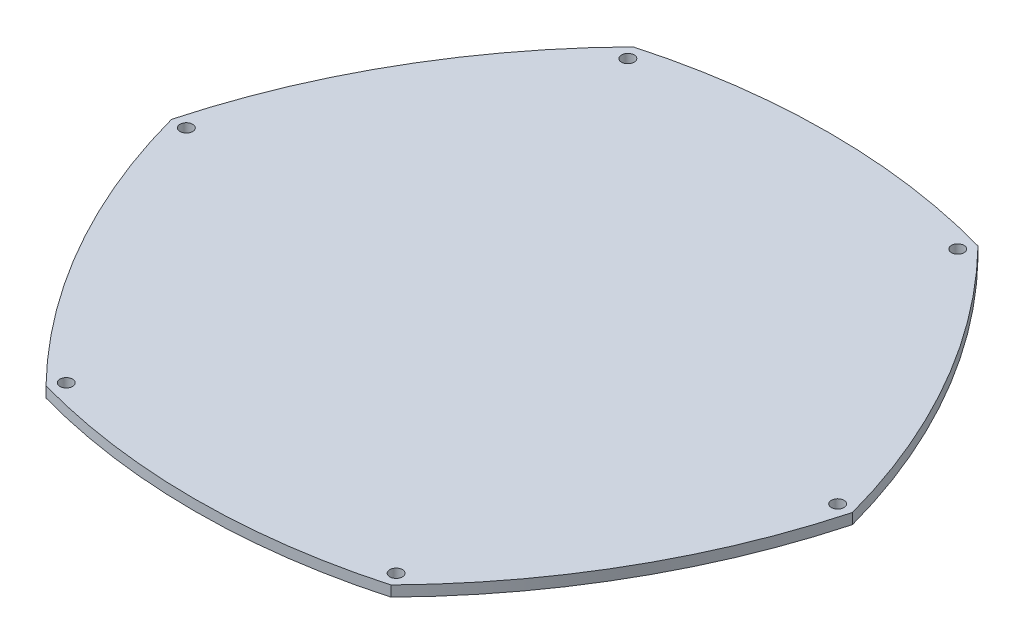
ISO-10303-21;
HEADER;
FILE_DESCRIPTION(('STEP AP214'),'2;1');
FILE_NAME('part.step','',(''),(''),'','','');
FILE_SCHEMA(('AUTOMOTIVE_DESIGN { 1 0 10303 214 1 1 1 1 }'));
ENDSEC;
DATA;
#1=APPLICATION_CONTEXT('core data for automotive mechanical design processes');
#2=APPLICATION_PROTOCOL_DEFINITION('international standard','automotive_design',2000,#1);
#3=PRODUCT_CONTEXT('',#1,'mechanical');
#4=PRODUCT('Part','Part','',(#3));
#5=PRODUCT_RELATED_PRODUCT_CATEGORY('part','',(#4));
#6=PRODUCT_DEFINITION_FORMATION('','',#4);
#7=PRODUCT_DEFINITION_CONTEXT('part definition',#1,'design');
#8=PRODUCT_DEFINITION('design','',#6,#7);
#9=PRODUCT_DEFINITION_SHAPE('','',#8);
#10=(LENGTH_UNIT() NAMED_UNIT(*) SI_UNIT(.MILLI.,.METRE.));
#11=(NAMED_UNIT(*) PLANE_ANGLE_UNIT() SI_UNIT($,.RADIAN.));
#12=(NAMED_UNIT(*) SI_UNIT($,.STERADIAN.) SOLID_ANGLE_UNIT());
#13=UNCERTAINTY_MEASURE_WITH_UNIT(LENGTH_MEASURE(1.E-05),#10,'distance_accuracy_value','');
#14=(GEOMETRIC_REPRESENTATION_CONTEXT(3) GLOBAL_UNCERTAINTY_ASSIGNED_CONTEXT((#13)) GLOBAL_UNIT_ASSIGNED_CONTEXT((#10,
#11,#12)) REPRESENTATION_CONTEXT('',''));
#15=CARTESIAN_POINT('',(0.,0.,0.));
#16=DIRECTION('',(0.,0.,1.));
#17=DIRECTION('',(1.,0.,0.));
#18=AXIS2_PLACEMENT_3D('',#15,#16,#17);
#19=CARTESIAN_POINT('',(72.2865141140493,2.5,-41.3732927207822));
#20=DIRECTION('',(0.,-1.,0.));
#21=DIRECTION('',(0.,0.,-1.));
#22=AXIS2_PLACEMENT_3D('',#19,#20,#21);
#23=CYLINDRICAL_SURFACE('',#22,158.289191815746);
#24=CARTESIAN_POINT('',(72.2865141140493,0.,-41.3732927207822));
#25=DIRECTION('',(0.,1.,0.));
#26=DIRECTION('',(0.,0.,1.));
#27=AXIS2_PLACEMENT_3D('',#24,#25,#26);
#28=CIRCLE('',#27,158.289191815746);
#29=CARTESIAN_POINT('',(-80.5,0.,4.71844785465692E-13));
#30=VERTEX_POINT('',#29);
#31=CARTESIAN_POINT('',(-40.7727272727273,0.,69.4106239040091));
#32=VERTEX_POINT('',#31);
#33=EDGE_CURVE('E137',#30,#32,#28,.T.);
#34=ORIENTED_EDGE('',*,*,#33,.T.);
#35=DIRECTION('',(0.,-1.,0.));
#36=VECTOR('',#35,1.);
#37=CARTESIAN_POINT('',(-40.7727272727273,2.5,69.4106239040091));
#38=LINE('',#37,#36);
#39=CARTESIAN_POINT('',(-40.7727272727273,2.5,69.4106239040091));
#40=VERTEX_POINT('',#39);
#41=EDGE_CURVE('E11',#40,#32,#38,.T.);
#42=ORIENTED_EDGE('',*,*,#41,.F.);
#43=CARTESIAN_POINT('',(72.2865141140493,2.5,-41.3732927207822));
#44=DIRECTION('',(0.,1.,0.));
#45=DIRECTION('',(0.,0.,1.));
#46=AXIS2_PLACEMENT_3D('',#43,#44,#45);
#47=CIRCLE('',#46,158.289191815746);
#48=CARTESIAN_POINT('',(-80.5,2.5,4.71844785465692E-13));
#49=VERTEX_POINT('',#48);
#50=EDGE_CURVE('E168',#49,#40,#47,.T.);
#51=ORIENTED_EDGE('',*,*,#50,.F.);
#52=DIRECTION('',(0.,-1.,0.));
#53=VECTOR('',#52,1.);
#54=CARTESIAN_POINT('',(-80.5,2.5,4.71844785465692E-13));
#55=LINE('',#54,#53);
#56=EDGE_CURVE('E50',#49,#30,#55,.T.);
#57=ORIENTED_EDGE('',*,*,#56,.T.);
#58=EDGE_LOOP('',(#34,#42,#51,#57));
#59=FACE_BOUND('',#58,.T.);
#60=ADVANCED_FACE('F34',(#59),#23,.T.);
#61=CARTESIAN_POINT('',(0.,2.5,-76.5067500658481));
#62=DIRECTION('',(0.,-1.,0.));
#63=DIRECTION('',(0.,0.,-1.));
#64=AXIS2_PLACEMENT_3D('',#61,#62,#63);
#65=CYLINDRICAL_SURFACE('',#64,151.506750065848);
#66=CARTESIAN_POINT('',(0.,0.,-76.5067500658481));
#67=DIRECTION('',(0.,1.,0.));
#68=DIRECTION('',(0.,0.,1.));
#69=AXIS2_PLACEMENT_3D('',#66,#67,#68);
#70=CIRCLE('',#69,151.506750065848);
#71=CARTESIAN_POINT('',(40.7727272727273,0.,69.4106239040091));
#72=VERTEX_POINT('',#71);
#73=EDGE_CURVE('E139',#32,#72,#70,.T.);
#74=ORIENTED_EDGE('',*,*,#73,.T.);
#75=DIRECTION('',(0.,-1.,0.));
#76=VECTOR('',#75,1.);
#77=CARTESIAN_POINT('',(40.7727272727273,2.5,69.4106239040091));
#78=LINE('',#77,#76);
#79=CARTESIAN_POINT('',(40.7727272727273,2.5,69.4106239040091));
#80=VERTEX_POINT('',#79);
#81=EDGE_CURVE('E42',#80,#72,#78,.T.);
#82=ORIENTED_EDGE('',*,*,#81,.F.);
#83=CARTESIAN_POINT('',(0.,2.5,-76.5067500658481));
#84=DIRECTION('',(0.,1.,0.));
#85=DIRECTION('',(0.,0.,1.));
#86=AXIS2_PLACEMENT_3D('',#83,#84,#85);
#87=CIRCLE('',#86,151.506750065848);
#88=EDGE_CURVE('E82',#40,#80,#87,.T.);
#89=ORIENTED_EDGE('',*,*,#88,.F.);
#90=ORIENTED_EDGE('',*,*,#41,.T.);
#91=EDGE_LOOP('',(#74,#82,#89,#90));
#92=FACE_BOUND('',#91,.T.);
#93=ADVANCED_FACE('F194',(#92),#65,.T.);
#94=CARTESIAN_POINT('',(-72.2865141140498,2.5,-41.3732927207825));
#95=DIRECTION('',(0.,-1.,0.));
#96=DIRECTION('',(0.,0.,-1.));
#97=AXIS2_PLACEMENT_3D('',#94,#95,#96);
#98=CYLINDRICAL_SURFACE('',#97,158.289191815747);
#99=CARTESIAN_POINT('',(-72.2865141140498,0.,-41.3732927207825));
#100=DIRECTION('',(0.,1.,0.));
#101=DIRECTION('',(0.,0.,1.));
#102=AXIS2_PLACEMENT_3D('',#99,#100,#101);
#103=CIRCLE('',#102,158.289191815747);
#104=CARTESIAN_POINT('',(80.5000000000001,0.,0.));
#105=VERTEX_POINT('',#104);
#106=EDGE_CURVE('E141',#72,#105,#103,.T.);
#107=ORIENTED_EDGE('',*,*,#106,.T.);
#108=DIRECTION('',(0.,-1.,0.));
#109=VECTOR('',#108,1.);
#110=CARTESIAN_POINT('',(80.5000000000001,2.5,0.));
#111=LINE('',#110,#109);
#112=CARTESIAN_POINT('',(80.5000000000001,2.5,0.));
#113=VERTEX_POINT('',#112);
#114=EDGE_CURVE('E101',#113,#105,#111,.T.);
#115=ORIENTED_EDGE('',*,*,#114,.F.);
#116=CARTESIAN_POINT('',(-72.2865141140498,2.5,-41.3732927207825));
#117=DIRECTION('',(0.,1.,0.));
#118=DIRECTION('',(0.,0.,1.));
#119=AXIS2_PLACEMENT_3D('',#116,#117,#118);
#120=CIRCLE('',#119,158.289191815747);
#121=EDGE_CURVE('E110',#80,#113,#120,.T.);
#122=ORIENTED_EDGE('',*,*,#121,.F.);
#123=ORIENTED_EDGE('',*,*,#81,.T.);
#124=EDGE_LOOP('',(#107,#115,#122,#123));
#125=FACE_BOUND('',#124,.T.);
#126=ADVANCED_FACE('F174',(#125),#98,.T.);
#127=CARTESIAN_POINT('',(-72.2865141140498,2.5,41.3732927207825));
#128=DIRECTION('',(0.,-1.,0.));
#129=DIRECTION('',(0.,0.,-1.));
#130=AXIS2_PLACEMENT_3D('',#127,#128,#129);
#131=CYLINDRICAL_SURFACE('',#130,158.289191815747);
#132=CARTESIAN_POINT('',(-72.2865141140498,0.,41.3732927207825));
#133=DIRECTION('',(0.,1.,0.));
#134=DIRECTION('',(0.,0.,1.));
#135=AXIS2_PLACEMENT_3D('',#132,#133,#134);
#136=CIRCLE('',#135,158.289191815747);
#137=CARTESIAN_POINT('',(40.7727272727273,0.,-69.4106239040091));
#138=VERTEX_POINT('',#137);
#139=EDGE_CURVE('E97',#138,#105,#136,.F.);
#140=ORIENTED_EDGE('',*,*,#139,.F.);
#141=DIRECTION('',(0.,-1.,0.));
#142=VECTOR('',#141,1.);
#143=CARTESIAN_POINT('',(40.7727272727273,2.5,-69.4106239040091));
#144=LINE('',#143,#142);
#145=CARTESIAN_POINT('',(40.7727272727273,2.5,-69.4106239040091));
#146=VERTEX_POINT('',#145);
#147=EDGE_CURVE('E92',#146,#138,#144,.T.);
#148=ORIENTED_EDGE('',*,*,#147,.F.);
#149=CARTESIAN_POINT('',(-72.2865141140498,2.5,41.3732927207825));
#150=DIRECTION('',(0.,1.,0.));
#151=DIRECTION('',(0.,0.,1.));
#152=AXIS2_PLACEMENT_3D('',#149,#150,#151);
#153=CIRCLE('',#152,158.289191815747);
#154=EDGE_CURVE('E95',#146,#113,#153,.F.);
#155=ORIENTED_EDGE('',*,*,#154,.T.);
#156=ORIENTED_EDGE('',*,*,#114,.T.);
#157=EDGE_LOOP('',(#140,#148,#155,#156));
#158=FACE_BOUND('',#157,.T.);
#159=ADVANCED_FACE('F94',(#158),#131,.T.);
#160=CARTESIAN_POINT('',(0.,2.5,76.5067500658481));
#161=DIRECTION('',(0.,-1.,0.));
#162=DIRECTION('',(0.,0.,-1.));
#163=AXIS2_PLACEMENT_3D('',#160,#161,#162);
#164=CYLINDRICAL_SURFACE('',#163,151.506750065848);
#165=CARTESIAN_POINT('',(0.,0.,76.5067500658481));
#166=DIRECTION('',(0.,1.,0.));
#167=DIRECTION('',(0.,0.,1.));
#168=AXIS2_PLACEMENT_3D('',#165,#166,#167);
#169=CIRCLE('',#168,151.506750065848);
#170=CARTESIAN_POINT('',(-40.7727272727272,0.,-69.410623904009));
#171=VERTEX_POINT('',#170);
#172=EDGE_CURVE('E145',#171,#138,#169,.F.);
#173=ORIENTED_EDGE('',*,*,#172,.F.);
#174=DIRECTION('',(0.,-1.,0.));
#175=VECTOR('',#174,1.);
#176=CARTESIAN_POINT('',(-40.7727272727272,2.5,-69.410623904009));
#177=LINE('',#176,#175);
#178=CARTESIAN_POINT('',(-40.7727272727272,2.5,-69.410623904009));
#179=VERTEX_POINT('',#178);
#180=EDGE_CURVE('E70',#179,#171,#177,.T.);
#181=ORIENTED_EDGE('',*,*,#180,.F.);
#182=CARTESIAN_POINT('',(0.,2.5,76.5067500658481));
#183=DIRECTION('',(0.,1.,0.));
#184=DIRECTION('',(0.,0.,1.));
#185=AXIS2_PLACEMENT_3D('',#182,#183,#184);
#186=CIRCLE('',#185,151.506750065848);
#187=EDGE_CURVE('E108',#179,#146,#186,.F.);
#188=ORIENTED_EDGE('',*,*,#187,.T.);
#189=ORIENTED_EDGE('',*,*,#147,.T.);
#190=EDGE_LOOP('',(#173,#181,#188,#189));
#191=FACE_BOUND('',#190,.T.);
#192=ADVANCED_FACE('F113',(#191),#164,.T.);
#193=CARTESIAN_POINT('',(77.,2.5,0.));
#194=DIRECTION('',(0.,-1.,0.));
#195=DIRECTION('',(0.,0.,-1.));
#196=AXIS2_PLACEMENT_3D('',#193,#194,#195);
#197=CYLINDRICAL_SURFACE('',#196,1.5);
#198=CARTESIAN_POINT('',(77.,2.5,0.));
#199=DIRECTION('',(0.,1.,0.));
#200=DIRECTION('',(0.,0.,1.));
#201=AXIS2_PLACEMENT_3D('',#198,#199,#200);
#202=CIRCLE('',#201,1.5);
#203=CARTESIAN_POINT('',(77.,2.5,1.5));
#204=VERTEX_POINT('',#203);
#205=EDGE_CURVE('E131',#204,#204,#202,.T.);
#206=ORIENTED_EDGE('',*,*,#205,.T.);
#207=EDGE_LOOP('',(#206));
#208=FACE_BOUND('',#207,.T.);
#209=CARTESIAN_POINT('',(77.,0.,0.));
#210=DIRECTION('',(0.,1.,0.));
#211=DIRECTION('',(0.,0.,1.));
#212=AXIS2_PLACEMENT_3D('',#209,#210,#211);
#213=CIRCLE('',#212,1.5);
#214=CARTESIAN_POINT('',(77.,0.,1.5));
#215=VERTEX_POINT('',#214);
#216=EDGE_CURVE('E162',#215,#215,#213,.T.);
#217=ORIENTED_EDGE('',*,*,#216,.F.);
#218=EDGE_LOOP('',(#217));
#219=FACE_BOUND('',#218,.T.);
#220=ADVANCED_FACE('F208',(#208,#219),#197,.F.);
#221=CARTESIAN_POINT('',(39.,2.5,-66.3927706907913));
#222=DIRECTION('',(0.,-1.,0.));
#223=DIRECTION('',(0.,0.,-1.));
#224=AXIS2_PLACEMENT_3D('',#221,#222,#223);
#225=CYLINDRICAL_SURFACE('',#224,1.5);
#226=CARTESIAN_POINT('',(39.,2.5,-66.3927706907913));
#227=DIRECTION('',(0.,1.,0.));
#228=DIRECTION('',(0.,0.,1.));
#229=AXIS2_PLACEMENT_3D('',#226,#227,#228);
#230=CIRCLE('',#229,1.5);
#231=CARTESIAN_POINT('',(39.,2.5,-64.8927706907913));
#232=VERTEX_POINT('',#231);
#233=EDGE_CURVE('E128',#232,#232,#230,.F.);
#234=ORIENTED_EDGE('',*,*,#233,.F.);
#235=EDGE_LOOP('',(#234));
#236=FACE_BOUND('',#235,.T.);
#237=CARTESIAN_POINT('',(39.,0.,-66.3927706907913));
#238=DIRECTION('',(0.,1.,0.));
#239=DIRECTION('',(0.,0.,1.));
#240=AXIS2_PLACEMENT_3D('',#237,#238,#239);
#241=CIRCLE('',#240,1.5);
#242=CARTESIAN_POINT('',(39.,0.,-64.8927706907913));
#243=VERTEX_POINT('',#242);
#244=EDGE_CURVE('E159',#243,#243,#241,.F.);
#245=ORIENTED_EDGE('',*,*,#244,.T.);
#246=EDGE_LOOP('',(#245));
#247=FACE_BOUND('',#246,.T.);
#248=ADVANCED_FACE('F212',(#236,#247),#225,.F.);
#249=CARTESIAN_POINT('',(-39.,2.5,-66.3927706907913));
#250=DIRECTION('',(0.,-1.,0.));
#251=DIRECTION('',(0.,0.,-1.));
#252=AXIS2_PLACEMENT_3D('',#249,#250,#251);
#253=CYLINDRICAL_SURFACE('',#252,1.5);
#254=CARTESIAN_POINT('',(-39.,2.5,-66.3927706907913));
#255=DIRECTION('',(0.,1.,0.));
#256=DIRECTION('',(0.,0.,1.));
#257=AXIS2_PLACEMENT_3D('',#254,#255,#256);
#258=CIRCLE('',#257,1.5);
#259=CARTESIAN_POINT('',(-39.,2.5,-64.8927706907913));
#260=VERTEX_POINT('',#259);
#261=EDGE_CURVE('E125',#260,#260,#258,.F.);
#262=ORIENTED_EDGE('',*,*,#261,.F.);
#263=EDGE_LOOP('',(#262));
#264=FACE_BOUND('',#263,.T.);
#265=CARTESIAN_POINT('',(-39.,0.,-66.3927706907913));
#266=DIRECTION('',(0.,1.,0.));
#267=DIRECTION('',(0.,0.,1.));
#268=AXIS2_PLACEMENT_3D('',#265,#266,#267);
#269=CIRCLE('',#268,1.5);
#270=CARTESIAN_POINT('',(-39.,0.,-64.8927706907913));
#271=VERTEX_POINT('',#270);
#272=EDGE_CURVE('E156',#271,#271,#269,.F.);
#273=ORIENTED_EDGE('',*,*,#272,.T.);
#274=EDGE_LOOP('',(#273));
#275=FACE_BOUND('',#274,.T.);
#276=ADVANCED_FACE('F218',(#264,#275),#253,.F.);
#277=CARTESIAN_POINT('',(-77.,2.5,0.));
#278=DIRECTION('',(0.,-1.,0.));
#279=DIRECTION('',(0.,0.,-1.));
#280=AXIS2_PLACEMENT_3D('',#277,#278,#279);
#281=CYLINDRICAL_SURFACE('',#280,1.5);
#282=CARTESIAN_POINT('',(-77.,2.5,0.));
#283=DIRECTION('',(0.,1.,0.));
#284=DIRECTION('',(0.,0.,1.));
#285=AXIS2_PLACEMENT_3D('',#282,#283,#284);
#286=CIRCLE('',#285,1.5);
#287=CARTESIAN_POINT('',(-77.,2.5,1.50000000000001));
#288=VERTEX_POINT('',#287);
#289=EDGE_CURVE('E122',#288,#288,#286,.T.);
#290=ORIENTED_EDGE('',*,*,#289,.T.);
#291=EDGE_LOOP('',(#290));
#292=FACE_BOUND('',#291,.T.);
#293=CARTESIAN_POINT('',(-77.,0.,0.));
#294=DIRECTION('',(0.,1.,0.));
#295=DIRECTION('',(0.,0.,1.));
#296=AXIS2_PLACEMENT_3D('',#293,#294,#295);
#297=CIRCLE('',#296,1.5);
#298=CARTESIAN_POINT('',(-77.,0.,1.50000000000001));
#299=VERTEX_POINT('',#298);
#300=EDGE_CURVE('E153',#299,#299,#297,.T.);
#301=ORIENTED_EDGE('',*,*,#300,.F.);
#302=EDGE_LOOP('',(#301));
#303=FACE_BOUND('',#302,.T.);
#304=ADVANCED_FACE('F189',(#292,#303),#281,.F.);
#305=CARTESIAN_POINT('',(-39.,2.5,66.3927706907913));
#306=DIRECTION('',(0.,-1.,0.));
#307=DIRECTION('',(0.,0.,-1.));
#308=AXIS2_PLACEMENT_3D('',#305,#306,#307);
#309=CYLINDRICAL_SURFACE('',#308,1.5);
#310=CARTESIAN_POINT('',(-39.,2.5,66.3927706907913));
#311=DIRECTION('',(0.,1.,0.));
#312=DIRECTION('',(0.,0.,1.));
#313=AXIS2_PLACEMENT_3D('',#310,#311,#312);
#314=CIRCLE('',#313,1.5);
#315=CARTESIAN_POINT('',(-39.,2.5,67.8927706907913));
#316=VERTEX_POINT('',#315);
#317=EDGE_CURVE('E116',#316,#316,#314,.T.);
#318=ORIENTED_EDGE('',*,*,#317,.T.);
#319=EDGE_LOOP('',(#318));
#320=FACE_BOUND('',#319,.T.);
#321=CARTESIAN_POINT('',(-39.,0.,66.3927706907913));
#322=DIRECTION('',(0.,1.,0.));
#323=DIRECTION('',(0.,0.,1.));
#324=AXIS2_PLACEMENT_3D('',#321,#322,#323);
#325=CIRCLE('',#324,1.5);
#326=CARTESIAN_POINT('',(-39.,0.,67.8927706907913));
#327=VERTEX_POINT('',#326);
#328=EDGE_CURVE('E150',#327,#327,#325,.T.);
#329=ORIENTED_EDGE('',*,*,#328,.F.);
#330=EDGE_LOOP('',(#329));
#331=FACE_BOUND('',#330,.T.);
#332=ADVANCED_FACE('F181',(#320,#331),#309,.F.);
#333=CARTESIAN_POINT('',(72.2865141140493,2.5,41.3732927207822));
#334=DIRECTION('',(0.,-1.,0.));
#335=DIRECTION('',(0.,0.,-1.));
#336=AXIS2_PLACEMENT_3D('',#333,#334,#335);
#337=CYLINDRICAL_SURFACE('',#336,158.289191815746);
#338=CARTESIAN_POINT('',(72.2865141140493,0.,41.3732927207822));
#339=DIRECTION('',(0.,1.,0.));
#340=DIRECTION('',(0.,0.,1.));
#341=AXIS2_PLACEMENT_3D('',#338,#339,#340);
#342=CIRCLE('',#341,158.289191815746);
#343=EDGE_CURVE('E147',#30,#171,#342,.F.);
#344=ORIENTED_EDGE('',*,*,#343,.F.);
#345=ORIENTED_EDGE('',*,*,#56,.F.);
#346=CARTESIAN_POINT('',(72.2865141140493,2.5,41.3732927207822));
#347=DIRECTION('',(0.,1.,0.));
#348=DIRECTION('',(0.,0.,1.));
#349=AXIS2_PLACEMENT_3D('',#346,#347,#348);
#350=CIRCLE('',#349,158.289191815746);
#351=EDGE_CURVE('E114',#49,#179,#350,.F.);
#352=ORIENTED_EDGE('',*,*,#351,.T.);
#353=ORIENTED_EDGE('',*,*,#180,.T.);
#354=EDGE_LOOP('',(#344,#345,#352,#353));
#355=FACE_BOUND('',#354,.T.);
#356=ADVANCED_FACE('F178',(#355),#337,.T.);
#357=CARTESIAN_POINT('',(39.,2.5,66.3927706907913));
#358=DIRECTION('',(0.,-1.,0.));
#359=DIRECTION('',(0.,0.,-1.));
#360=AXIS2_PLACEMENT_3D('',#357,#358,#359);
#361=CYLINDRICAL_SURFACE('',#360,1.5);
#362=CARTESIAN_POINT('',(39.,2.5,66.3927706907913));
#363=DIRECTION('',(0.,1.,0.));
#364=DIRECTION('',(0.,0.,1.));
#365=AXIS2_PLACEMENT_3D('',#362,#363,#364);
#366=CIRCLE('',#365,1.5);
#367=CARTESIAN_POINT('',(39.,2.5,67.8927706907913));
#368=VERTEX_POINT('',#367);
#369=EDGE_CURVE('E134',#368,#368,#366,.T.);
#370=ORIENTED_EDGE('',*,*,#369,.T.);
#371=EDGE_LOOP('',(#370));
#372=FACE_BOUND('',#371,.T.);
#373=CARTESIAN_POINT('',(39.,0.,66.3927706907913));
#374=DIRECTION('',(0.,1.,0.));
#375=DIRECTION('',(0.,0.,1.));
#376=AXIS2_PLACEMENT_3D('',#373,#374,#375);
#377=CIRCLE('',#376,1.5);
#378=CARTESIAN_POINT('',(39.,0.,67.8927706907913));
#379=VERTEX_POINT('',#378);
#380=EDGE_CURVE('E165',#379,#379,#377,.T.);
#381=ORIENTED_EDGE('',*,*,#380,.F.);
#382=EDGE_LOOP('',(#381));
#383=FACE_BOUND('',#382,.T.);
#384=ADVANCED_FACE('F180',(#372,#383),#361,.F.);
#385=CARTESIAN_POINT('',(-171.298381483484,2.5,0.));
#386=DIRECTION('',(0.,1.,0.));
#387=DIRECTION('',(0.,0.,1.));
#388=AXIS2_PLACEMENT_3D('',#385,#386,#387);
#389=PLANE('',#388);
#390=ORIENTED_EDGE('',*,*,#50,.T.);
#391=ORIENTED_EDGE('',*,*,#88,.T.);
#392=ORIENTED_EDGE('',*,*,#121,.T.);
#393=ORIENTED_EDGE('',*,*,#154,.F.);
#394=ORIENTED_EDGE('',*,*,#187,.F.);
#395=ORIENTED_EDGE('',*,*,#351,.F.);
#396=EDGE_LOOP('',(#390,#391,#392,#393,#394,#395));
#397=FACE_BOUND('',#396,.T.);
#398=ORIENTED_EDGE('',*,*,#317,.F.);
#399=EDGE_LOOP('',(#398));
#400=FACE_BOUND('',#399,.T.);
#401=ORIENTED_EDGE('',*,*,#289,.F.);
#402=EDGE_LOOP('',(#401));
#403=FACE_BOUND('',#402,.T.);
#404=ORIENTED_EDGE('',*,*,#261,.T.);
#405=EDGE_LOOP('',(#404));
#406=FACE_BOUND('',#405,.T.);
#407=ORIENTED_EDGE('',*,*,#233,.T.);
#408=EDGE_LOOP('',(#407));
#409=FACE_BOUND('',#408,.T.);
#410=ORIENTED_EDGE('',*,*,#205,.F.);
#411=EDGE_LOOP('',(#410));
#412=FACE_BOUND('',#411,.T.);
#413=ORIENTED_EDGE('',*,*,#369,.F.);
#414=EDGE_LOOP('',(#413));
#415=FACE_BOUND('',#414,.T.);
#416=ADVANCED_FACE('F105',(#397,#400,#403,#406,#409,#412,#415),#389,.T.);
#417=CARTESIAN_POINT('',(-171.298381483484,0.,0.));
#418=DIRECTION('',(0.,1.,0.));
#419=DIRECTION('',(0.,0.,1.));
#420=AXIS2_PLACEMENT_3D('',#417,#418,#419);
#421=PLANE('',#420);
#422=ORIENTED_EDGE('',*,*,#33,.F.);
#423=ORIENTED_EDGE('',*,*,#343,.T.);
#424=ORIENTED_EDGE('',*,*,#172,.T.);
#425=ORIENTED_EDGE('',*,*,#139,.T.);
#426=ORIENTED_EDGE('',*,*,#106,.F.);
#427=ORIENTED_EDGE('',*,*,#73,.F.);
#428=EDGE_LOOP('',(#422,#423,#424,#425,#426,#427));
#429=FACE_BOUND('',#428,.T.);
#430=ORIENTED_EDGE('',*,*,#328,.T.);
#431=EDGE_LOOP('',(#430));
#432=FACE_BOUND('',#431,.T.);
#433=ORIENTED_EDGE('',*,*,#300,.T.);
#434=EDGE_LOOP('',(#433));
#435=FACE_BOUND('',#434,.T.);
#436=ORIENTED_EDGE('',*,*,#272,.F.);
#437=EDGE_LOOP('',(#436));
#438=FACE_BOUND('',#437,.T.);
#439=ORIENTED_EDGE('',*,*,#244,.F.);
#440=EDGE_LOOP('',(#439));
#441=FACE_BOUND('',#440,.T.);
#442=ORIENTED_EDGE('',*,*,#216,.T.);
#443=EDGE_LOOP('',(#442));
#444=FACE_BOUND('',#443,.T.);
#445=ORIENTED_EDGE('',*,*,#380,.T.);
#446=EDGE_LOOP('',(#445));
#447=FACE_BOUND('',#446,.T.);
#448=ADVANCED_FACE('F176',(#429,#432,#435,#438,#441,#444,#447),#421,.F.);
#449=CLOSED_SHELL('',(#60,#93,#126,#159,#192,#220,#248,#276,#304,#332,#356,#384,#416,#448));
#450=MANIFOLD_SOLID_BREP('B2',#449);
#451=ADVANCED_BREP_SHAPE_REPRESENTATION('',(#18,#450),#14);
#452=SHAPE_DEFINITION_REPRESENTATION(#9,#451);
ENDSEC;
END-ISO-10303-21;
